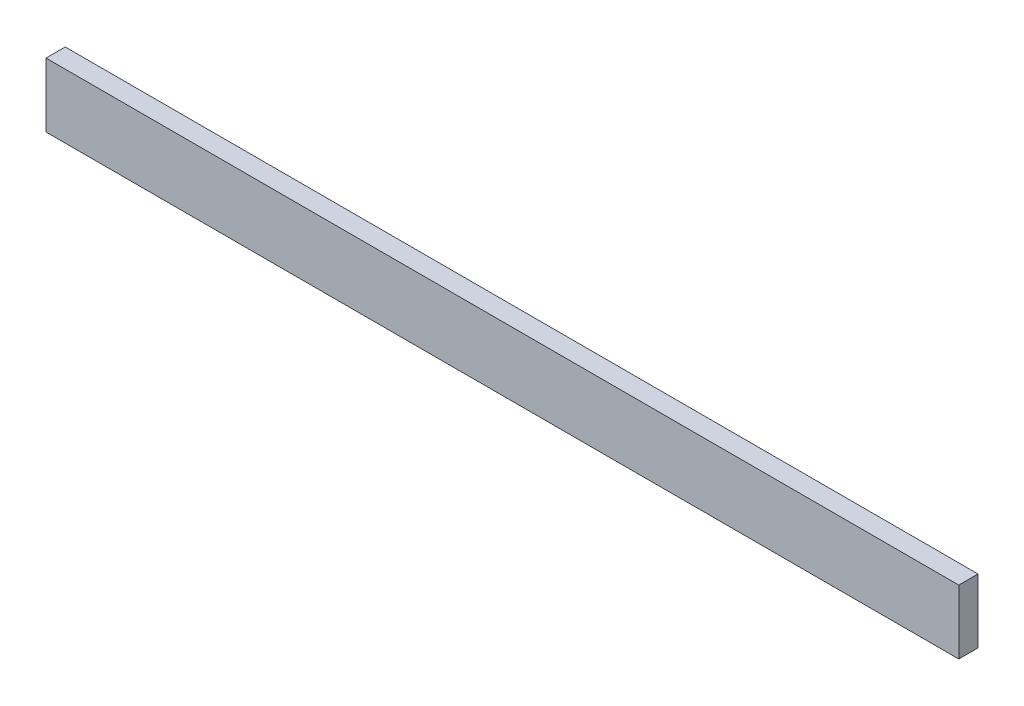
ISO-10303-21;
HEADER;
FILE_DESCRIPTION(('STEP AP214'),'2;1');
FILE_NAME('part.step','',(''),(''),'','','');
FILE_SCHEMA(('AUTOMOTIVE_DESIGN { 1 0 10303 214 1 1 1 1 }'));
ENDSEC;
DATA;
#1=APPLICATION_CONTEXT('core data for automotive mechanical design processes');
#2=APPLICATION_PROTOCOL_DEFINITION('international standard','automotive_design',2000,#1);
#3=PRODUCT_CONTEXT('',#1,'mechanical');
#4=PRODUCT('Part','Part','',(#3));
#5=PRODUCT_RELATED_PRODUCT_CATEGORY('part','',(#4));
#6=PRODUCT_DEFINITION_FORMATION('','',#4);
#7=PRODUCT_DEFINITION_CONTEXT('part definition',#1,'design');
#8=PRODUCT_DEFINITION('design','',#6,#7);
#9=PRODUCT_DEFINITION_SHAPE('','',#8);
#10=(LENGTH_UNIT() NAMED_UNIT(*) SI_UNIT(.MILLI.,.METRE.));
#11=(NAMED_UNIT(*) PLANE_ANGLE_UNIT() SI_UNIT($,.RADIAN.));
#12=(NAMED_UNIT(*) SI_UNIT($,.STERADIAN.) SOLID_ANGLE_UNIT());
#13=UNCERTAINTY_MEASURE_WITH_UNIT(LENGTH_MEASURE(1.E-05),#10,'distance_accuracy_value','');
#14=(GEOMETRIC_REPRESENTATION_CONTEXT(3) GLOBAL_UNCERTAINTY_ASSIGNED_CONTEXT((#13)) GLOBAL_UNIT_ASSIGNED_CONTEXT((#10,
#11,#12)) REPRESENTATION_CONTEXT('',''));
#15=CARTESIAN_POINT('',(0.,0.,0.));
#16=DIRECTION('',(0.,0.,1.));
#17=DIRECTION('',(1.,0.,0.));
#18=AXIS2_PLACEMENT_3D('',#15,#16,#17);
#19=CARTESIAN_POINT('',(28.7186555507849,31.6181571305266,6.));
#20=DIRECTION('',(0.,1.,0.));
#21=DIRECTION('',(0.,0.,1.));
#22=AXIS2_PLACEMENT_3D('',#19,#20,#21);
#23=PLANE('',#22);
#24=DIRECTION('',(1.,0.,0.));
#25=VECTOR('',#24,1.);
#26=CARTESIAN_POINT('',(28.7186555507849,31.6181571305266,0.));
#27=LINE('',#26,#25);
#28=CARTESIAN_POINT('',(28.7186555507849,31.6181571305266,0.));
#29=VERTEX_POINT('',#28);
#30=CARTESIAN_POINT('',(313.718655550785,31.6181571305266,0.));
#31=VERTEX_POINT('',#30);
#32=EDGE_CURVE('E110',#29,#31,#27,.T.);
#33=ORIENTED_EDGE('',*,*,#32,.F.);
#34=DIRECTION('',(0.,0.,-1.));
#35=VECTOR('',#34,1.);
#36=CARTESIAN_POINT('',(28.7186555507849,31.6181571305266,6.));
#37=LINE('',#36,#35);
#38=CARTESIAN_POINT('',(28.7186555507849,31.6181571305266,6.));
#39=VERTEX_POINT('',#38);
#40=EDGE_CURVE('E11',#39,#29,#37,.T.);
#41=ORIENTED_EDGE('',*,*,#40,.F.);
#42=DIRECTION('',(1.,0.,0.));
#43=VECTOR('',#42,1.);
#44=CARTESIAN_POINT('',(28.7186555507849,31.6181571305266,6.));
#45=LINE('',#44,#43);
#46=CARTESIAN_POINT('',(313.718655550785,31.6181571305266,6.));
#47=VERTEX_POINT('',#46);
#48=EDGE_CURVE('E102',#39,#47,#45,.T.);
#49=ORIENTED_EDGE('',*,*,#48,.T.);
#50=DIRECTION('',(0.,0.,-1.));
#51=VECTOR('',#50,1.);
#52=CARTESIAN_POINT('',(313.718655550785,31.6181571305266,6.));
#53=LINE('',#52,#51);
#54=EDGE_CURVE('E42',#47,#31,#53,.T.);
#55=ORIENTED_EDGE('',*,*,#54,.T.);
#56=EDGE_LOOP('',(#33,#41,#49,#55));
#57=FACE_BOUND('',#56,.T.);
#58=ADVANCED_FACE('F39',(#57),#23,.T.);
#59=CARTESIAN_POINT('',(28.7186555507849,31.6181571305266,6.));
#60=DIRECTION('',(1.,0.,0.));
#61=DIRECTION('',(0.,0.,-1.));
#62=AXIS2_PLACEMENT_3D('',#59,#60,#61);
#63=PLANE('',#62);
#64=DIRECTION('',(0.,-1.,0.));
#65=VECTOR('',#64,1.);
#66=CARTESIAN_POINT('',(28.7186555507849,31.6181571305266,0.));
#67=LINE('',#66,#65);
#68=CARTESIAN_POINT('',(28.7186555507849,11.6181571305266,0.));
#69=VERTEX_POINT('',#68);
#70=EDGE_CURVE('E105',#29,#69,#67,.T.);
#71=ORIENTED_EDGE('',*,*,#70,.T.);
#72=DIRECTION('',(0.,0.,-1.));
#73=VECTOR('',#72,1.);
#74=CARTESIAN_POINT('',(28.7186555507849,11.6181571305266,6.));
#75=LINE('',#74,#73);
#76=CARTESIAN_POINT('',(28.7186555507849,11.6181571305266,6.));
#77=VERTEX_POINT('',#76);
#78=EDGE_CURVE('E49',#77,#69,#75,.T.);
#79=ORIENTED_EDGE('',*,*,#78,.F.);
#80=DIRECTION('',(0.,-1.,0.));
#81=VECTOR('',#80,1.);
#82=CARTESIAN_POINT('',(28.7186555507849,31.6181571305266,6.));
#83=LINE('',#82,#81);
#84=EDGE_CURVE('E97',#39,#77,#83,.T.);
#85=ORIENTED_EDGE('',*,*,#84,.F.);
#86=ORIENTED_EDGE('',*,*,#40,.T.);
#87=EDGE_LOOP('',(#71,#79,#85,#86));
#88=FACE_BOUND('',#87,.T.);
#89=ADVANCED_FACE('F125',(#88),#63,.F.);
#90=CARTESIAN_POINT('',(313.718655550785,11.6181571305266,6.));
#91=DIRECTION('',(0.,-1.,0.));
#92=DIRECTION('',(0.,0.,-1.));
#93=AXIS2_PLACEMENT_3D('',#90,#91,#92);
#94=PLANE('',#93);
#95=DIRECTION('',(-1.,0.,0.));
#96=VECTOR('',#95,1.);
#97=CARTESIAN_POINT('',(313.718655550785,11.6181571305266,0.));
#98=LINE('',#97,#96);
#99=CARTESIAN_POINT('',(313.718655550785,11.6181571305266,0.));
#100=VERTEX_POINT('',#99);
#101=EDGE_CURVE('E90',#100,#69,#98,.T.);
#102=ORIENTED_EDGE('',*,*,#101,.F.);
#103=DIRECTION('',(0.,0.,-1.));
#104=VECTOR('',#103,1.);
#105=CARTESIAN_POINT('',(313.718655550785,11.6181571305266,6.));
#106=LINE('',#105,#104);
#107=CARTESIAN_POINT('',(313.718655550785,11.6181571305266,6.));
#108=VERTEX_POINT('',#107);
#109=EDGE_CURVE('E85',#108,#100,#106,.T.);
#110=ORIENTED_EDGE('',*,*,#109,.F.);
#111=DIRECTION('',(-1.,0.,0.));
#112=VECTOR('',#111,1.);
#113=CARTESIAN_POINT('',(313.718655550785,11.6181571305266,6.));
#114=LINE('',#113,#112);
#115=EDGE_CURVE('E88',#108,#77,#114,.T.);
#116=ORIENTED_EDGE('',*,*,#115,.T.);
#117=ORIENTED_EDGE('',*,*,#78,.T.);
#118=EDGE_LOOP('',(#102,#110,#116,#117));
#119=FACE_BOUND('',#118,.T.);
#120=ADVANCED_FACE('F87',(#119),#94,.T.);
#121=CARTESIAN_POINT('',(313.718655550785,31.6181571305266,6.));
#122=DIRECTION('',(1.,0.,0.));
#123=DIRECTION('',(0.,0.,-1.));
#124=AXIS2_PLACEMENT_3D('',#121,#122,#123);
#125=PLANE('',#124);
#126=DIRECTION('',(0.,-1.,0.));
#127=VECTOR('',#126,1.);
#128=CARTESIAN_POINT('',(313.718655550785,31.6181571305266,0.));
#129=LINE('',#128,#127);
#130=EDGE_CURVE('E114',#31,#100,#129,.T.);
#131=ORIENTED_EDGE('',*,*,#130,.F.);
#132=ORIENTED_EDGE('',*,*,#54,.F.);
#133=DIRECTION('',(0.,-1.,0.));
#134=VECTOR('',#133,1.);
#135=CARTESIAN_POINT('',(313.718655550785,31.6181571305266,6.));
#136=LINE('',#135,#134);
#137=EDGE_CURVE('E96',#47,#108,#136,.T.);
#138=ORIENTED_EDGE('',*,*,#137,.T.);
#139=ORIENTED_EDGE('',*,*,#109,.T.);
#140=EDGE_LOOP('',(#131,#132,#138,#139));
#141=FACE_BOUND('',#140,.T.);
#142=ADVANCED_FACE('F100',(#141),#125,.T.);
#143=CARTESIAN_POINT('',(0.,0.,6.));
#144=DIRECTION('',(0.,0.,-1.));
#145=DIRECTION('',(-1.,0.,0.));
#146=AXIS2_PLACEMENT_3D('',#143,#144,#145);
#147=PLANE('',#146);
#148=ORIENTED_EDGE('',*,*,#48,.F.);
#149=ORIENTED_EDGE('',*,*,#84,.T.);
#150=ORIENTED_EDGE('',*,*,#115,.F.);
#151=ORIENTED_EDGE('',*,*,#137,.F.);
#152=EDGE_LOOP('',(#148,#149,#150,#151));
#153=FACE_BOUND('',#152,.T.);
#154=ADVANCED_FACE('F95',(#153),#147,.F.);
#155=CARTESIAN_POINT('',(0.,0.,0.));
#156=DIRECTION('',(0.,0.,-1.));
#157=DIRECTION('',(-1.,0.,0.));
#158=AXIS2_PLACEMENT_3D('',#155,#156,#157);
#159=PLANE('',#158);
#160=ORIENTED_EDGE('',*,*,#32,.T.);
#161=ORIENTED_EDGE('',*,*,#130,.T.);
#162=ORIENTED_EDGE('',*,*,#101,.T.);
#163=ORIENTED_EDGE('',*,*,#70,.F.);
#164=EDGE_LOOP('',(#160,#161,#162,#163));
#165=FACE_BOUND('',#164,.T.);
#166=ADVANCED_FACE('F124',(#165),#159,.T.);
#167=CLOSED_SHELL('',(#58,#89,#120,#142,#154,#166));
#168=MANIFOLD_SOLID_BREP('B2',#167);
#169=ADVANCED_BREP_SHAPE_REPRESENTATION('',(#18,#168),#14);
#170=SHAPE_DEFINITION_REPRESENTATION(#9,#169);
ENDSEC;
END-ISO-10303-21;
